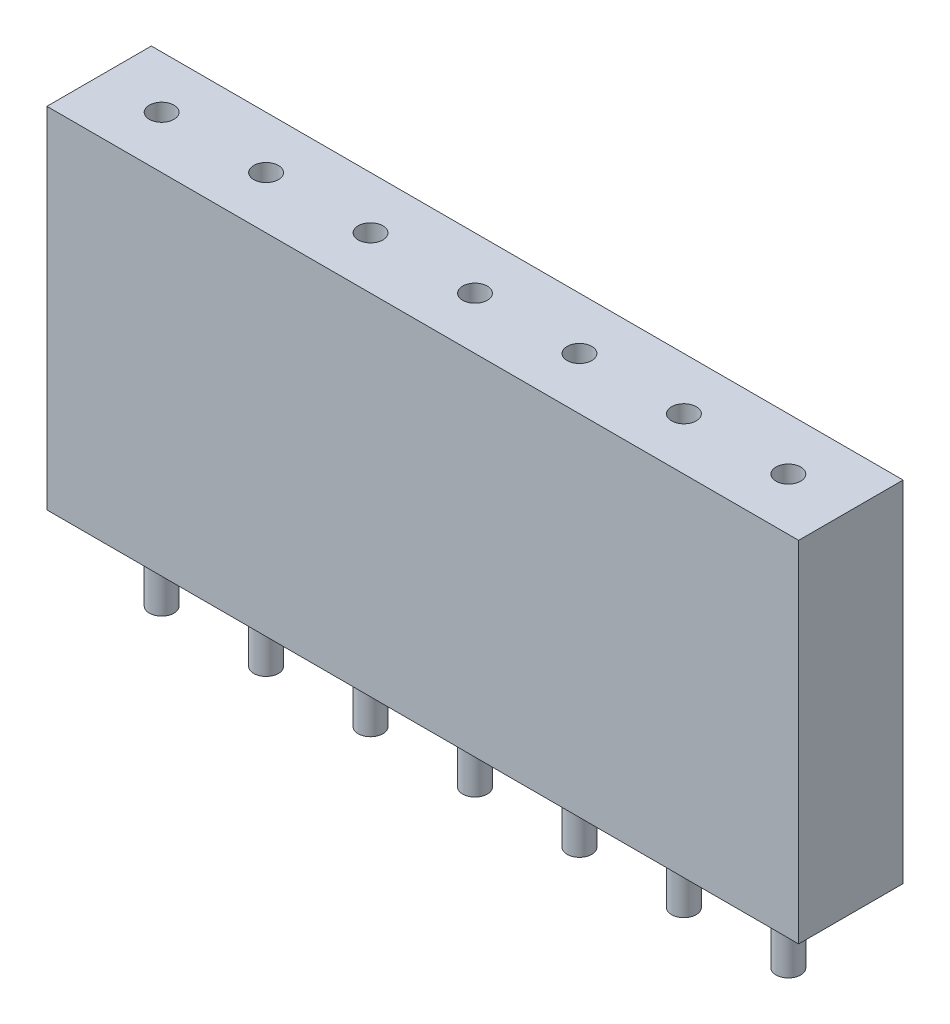
ISO-10303-21;
HEADER;
FILE_DESCRIPTION(('STEP AP214'),'2;1');
FILE_NAME('part.step','',(''),(''),'','','');
FILE_SCHEMA(('AUTOMOTIVE_DESIGN { 1 0 10303 214 1 1 1 1 }'));
ENDSEC;
DATA;
#1=APPLICATION_CONTEXT('core data for automotive mechanical design processes');
#2=APPLICATION_PROTOCOL_DEFINITION('international standard','automotive_design',2000,#1);
#3=PRODUCT_CONTEXT('',#1,'mechanical');
#4=PRODUCT('Part','Part','',(#3));
#5=PRODUCT_RELATED_PRODUCT_CATEGORY('part','',(#4));
#6=PRODUCT_DEFINITION_FORMATION('','',#4);
#7=PRODUCT_DEFINITION_CONTEXT('part definition',#1,'design');
#8=PRODUCT_DEFINITION('design','',#6,#7);
#9=PRODUCT_DEFINITION_SHAPE('','',#8);
#10=(LENGTH_UNIT() NAMED_UNIT(*) SI_UNIT(.MILLI.,.METRE.));
#11=(NAMED_UNIT(*) PLANE_ANGLE_UNIT() SI_UNIT($,.RADIAN.));
#12=(NAMED_UNIT(*) SI_UNIT($,.STERADIAN.) SOLID_ANGLE_UNIT());
#13=UNCERTAINTY_MEASURE_WITH_UNIT(LENGTH_MEASURE(1.E-05),#10,'distance_accuracy_value','');
#14=(GEOMETRIC_REPRESENTATION_CONTEXT(3) GLOBAL_UNCERTAINTY_ASSIGNED_CONTEXT((#13)) GLOBAL_UNIT_ASSIGNED_CONTEXT((#10,
#11,#12)) REPRESENTATION_CONTEXT('',''));
#15=CARTESIAN_POINT('',(0.,0.,0.));
#16=DIRECTION('',(0.,0.,1.));
#17=DIRECTION('',(1.,0.,0.));
#18=AXIS2_PLACEMENT_3D('',#15,#16,#17);
#19=CARTESIAN_POINT('',(7.61999999999998,-1.9,0.));
#20=DIRECTION('',(0.,1.,0.));
#21=DIRECTION('',(0.,0.,1.));
#22=AXIS2_PLACEMENT_3D('',#19,#20,#21);
#23=CYLINDRICAL_SURFACE('',#22,0.3);
#24=CARTESIAN_POINT('',(7.61999999999998,-1.9,0.));
#25=DIRECTION('',(0.,-1.,0.));
#26=DIRECTION('',(0.,0.,-1.));
#27=AXIS2_PLACEMENT_3D('',#24,#25,#26);
#28=CIRCLE('',#27,0.3);
#29=CARTESIAN_POINT('',(7.61999999999998,-1.9,-0.3));
#30=VERTEX_POINT('',#29);
#31=EDGE_CURVE('E11',#30,#30,#28,.T.);
#32=ORIENTED_EDGE('',*,*,#31,.F.);
#33=EDGE_LOOP('',(#32));
#34=FACE_BOUND('',#33,.T.);
#35=CARTESIAN_POINT('',(7.61999999999998,0.,0.));
#36=DIRECTION('',(0.,-1.,0.));
#37=DIRECTION('',(0.,0.,-1.));
#38=AXIS2_PLACEMENT_3D('',#35,#36,#37);
#39=CIRCLE('',#38,0.3);
#40=CARTESIAN_POINT('',(7.61999999999998,0.,-0.3));
#41=VERTEX_POINT('',#40);
#42=EDGE_CURVE('E42',#41,#41,#39,.T.);
#43=ORIENTED_EDGE('',*,*,#42,.T.);
#44=EDGE_LOOP('',(#43));
#45=FACE_BOUND('',#44,.T.);
#46=ADVANCED_FACE('F39',(#34,#45),#23,.T.);
#47=CARTESIAN_POINT('',(7.61999999999998,-1.9,0.));
#48=DIRECTION('',(0.,-1.,0.));
#49=DIRECTION('',(0.,0.,-1.));
#50=AXIS2_PLACEMENT_3D('',#47,#48,#49);
#51=PLANE('',#50);
#52=ORIENTED_EDGE('',*,*,#31,.T.);
#53=EDGE_LOOP('',(#52));
#54=FACE_BOUND('',#53,.T.);
#55=ADVANCED_FACE('F54',(#54),#51,.T.);
#56=CARTESIAN_POINT('',(7.61999999999998,0.,0.));
#57=DIRECTION('',(0.,-1.,0.));
#58=DIRECTION('',(0.,0.,-1.));
#59=AXIS2_PLACEMENT_3D('',#56,#57,#58);
#60=PLANE('',#59);
#61=ORIENTED_EDGE('',*,*,#42,.F.);
#62=EDGE_LOOP('',(#61));
#63=FACE_BOUND('',#62,.T.);
#64=ADVANCED_FACE('F52',(#63),#60,.F.);
#65=CLOSED_SHELL('',(#46,#55,#64));
#66=MANIFOLD_SOLID_BREP('B2',#65);
#67=CARTESIAN_POINT('',(5.07999999999998,-1.9,0.));
#68=DIRECTION('',(0.,1.,0.));
#69=DIRECTION('',(0.,0.,1.));
#70=AXIS2_PLACEMENT_3D('',#67,#68,#69);
#71=CYLINDRICAL_SURFACE('',#70,0.3);
#72=CARTESIAN_POINT('',(5.07999999999998,-1.9,0.));
#73=DIRECTION('',(0.,-1.,0.));
#74=DIRECTION('',(0.,0.,-1.));
#75=AXIS2_PLACEMENT_3D('',#72,#73,#74);
#76=CIRCLE('',#75,0.3);
#77=CARTESIAN_POINT('',(5.07999999999998,-1.9,-0.3));
#78=VERTEX_POINT('',#77);
#79=EDGE_CURVE('E38',#78,#78,#76,.T.);
#80=ORIENTED_EDGE('',*,*,#79,.F.);
#81=EDGE_LOOP('',(#80));
#82=FACE_BOUND('',#81,.T.);
#83=CARTESIAN_POINT('',(5.07999999999998,0.,0.));
#84=DIRECTION('',(0.,-1.,0.));
#85=DIRECTION('',(0.,0.,-1.));
#86=AXIS2_PLACEMENT_3D('',#83,#84,#85);
#87=CIRCLE('',#86,0.3);
#88=CARTESIAN_POINT('',(5.07999999999998,0.,-0.3));
#89=VERTEX_POINT('',#88);
#90=EDGE_CURVE('E90',#89,#89,#87,.T.);
#91=ORIENTED_EDGE('',*,*,#90,.T.);
#92=EDGE_LOOP('',(#91));
#93=FACE_BOUND('',#92,.T.);
#94=ADVANCED_FACE('F87',(#82,#93),#71,.T.);
#95=CARTESIAN_POINT('',(5.07999999999998,-1.9,0.));
#96=DIRECTION('',(0.,-1.,0.));
#97=DIRECTION('',(0.,0.,-1.));
#98=AXIS2_PLACEMENT_3D('',#95,#96,#97);
#99=PLANE('',#98);
#100=ORIENTED_EDGE('',*,*,#79,.T.);
#101=EDGE_LOOP('',(#100));
#102=FACE_BOUND('',#101,.T.);
#103=ADVANCED_FACE('F102',(#102),#99,.T.);
#104=CARTESIAN_POINT('',(5.07999999999998,0.,0.));
#105=DIRECTION('',(0.,-1.,0.));
#106=DIRECTION('',(0.,0.,-1.));
#107=AXIS2_PLACEMENT_3D('',#104,#105,#106);
#108=PLANE('',#107);
#109=ORIENTED_EDGE('',*,*,#90,.F.);
#110=EDGE_LOOP('',(#109));
#111=FACE_BOUND('',#110,.T.);
#112=ADVANCED_FACE('F100',(#111),#108,.F.);
#113=CLOSED_SHELL('',(#94,#103,#112));
#114=MANIFOLD_SOLID_BREP('B6',#113);
#115=CARTESIAN_POINT('',(2.53999999999998,-1.9,0.));
#116=DIRECTION('',(0.,1.,0.));
#117=DIRECTION('',(0.,0.,1.));
#118=AXIS2_PLACEMENT_3D('',#115,#116,#117);
#119=CYLINDRICAL_SURFACE('',#118,0.3);
#120=CARTESIAN_POINT('',(2.53999999999998,-1.9,0.));
#121=DIRECTION('',(0.,-1.,0.));
#122=DIRECTION('',(0.,0.,-1.));
#123=AXIS2_PLACEMENT_3D('',#120,#121,#122);
#124=CIRCLE('',#123,0.3);
#125=CARTESIAN_POINT('',(2.53999999999998,-1.9,-0.3));
#126=VERTEX_POINT('',#125);
#127=EDGE_CURVE('E86',#126,#126,#124,.T.);
#128=ORIENTED_EDGE('',*,*,#127,.F.);
#129=EDGE_LOOP('',(#128));
#130=FACE_BOUND('',#129,.T.);
#131=CARTESIAN_POINT('',(2.53999999999998,0.,0.));
#132=DIRECTION('',(0.,-1.,0.));
#133=DIRECTION('',(0.,0.,-1.));
#134=AXIS2_PLACEMENT_3D('',#131,#132,#133);
#135=CIRCLE('',#134,0.3);
#136=CARTESIAN_POINT('',(2.53999999999998,0.,-0.3));
#137=VERTEX_POINT('',#136);
#138=EDGE_CURVE('E138',#137,#137,#135,.T.);
#139=ORIENTED_EDGE('',*,*,#138,.T.);
#140=EDGE_LOOP('',(#139));
#141=FACE_BOUND('',#140,.T.);
#142=ADVANCED_FACE('F135',(#130,#141),#119,.T.);
#143=CARTESIAN_POINT('',(2.53999999999998,-1.9,0.));
#144=DIRECTION('',(0.,-1.,0.));
#145=DIRECTION('',(0.,0.,-1.));
#146=AXIS2_PLACEMENT_3D('',#143,#144,#145);
#147=PLANE('',#146);
#148=ORIENTED_EDGE('',*,*,#127,.T.);
#149=EDGE_LOOP('',(#148));
#150=FACE_BOUND('',#149,.T.);
#151=ADVANCED_FACE('F150',(#150),#147,.T.);
#152=CARTESIAN_POINT('',(2.53999999999998,0.,0.));
#153=DIRECTION('',(0.,-1.,0.));
#154=DIRECTION('',(0.,0.,-1.));
#155=AXIS2_PLACEMENT_3D('',#152,#153,#154);
#156=PLANE('',#155);
#157=ORIENTED_EDGE('',*,*,#138,.F.);
#158=EDGE_LOOP('',(#157));
#159=FACE_BOUND('',#158,.T.);
#160=ADVANCED_FACE('F148',(#159),#156,.F.);
#161=CLOSED_SHELL('',(#142,#151,#160));
#162=MANIFOLD_SOLID_BREP('B33',#161);
#163=CARTESIAN_POINT('',(0.,-1.9,0.));
#164=DIRECTION('',(0.,1.,0.));
#165=DIRECTION('',(0.,0.,1.));
#166=AXIS2_PLACEMENT_3D('',#163,#164,#165);
#167=CYLINDRICAL_SURFACE('',#166,0.3);
#168=CARTESIAN_POINT('',(0.,-1.9,0.));
#169=DIRECTION('',(0.,-1.,0.));
#170=DIRECTION('',(0.,0.,-1.));
#171=AXIS2_PLACEMENT_3D('',#168,#169,#170);
#172=CIRCLE('',#171,0.3);
#173=CARTESIAN_POINT('',(0.,-1.9,-0.3));
#174=VERTEX_POINT('',#173);
#175=EDGE_CURVE('E134',#174,#174,#172,.T.);
#176=ORIENTED_EDGE('',*,*,#175,.F.);
#177=EDGE_LOOP('',(#176));
#178=FACE_BOUND('',#177,.T.);
#179=CARTESIAN_POINT('',(0.,0.,0.));
#180=DIRECTION('',(0.,-1.,0.));
#181=DIRECTION('',(0.,0.,-1.));
#182=AXIS2_PLACEMENT_3D('',#179,#180,#181);
#183=CIRCLE('',#182,0.3);
#184=CARTESIAN_POINT('',(0.,0.,-0.3));
#185=VERTEX_POINT('',#184);
#186=EDGE_CURVE('E186',#185,#185,#183,.T.);
#187=ORIENTED_EDGE('',*,*,#186,.T.);
#188=EDGE_LOOP('',(#187));
#189=FACE_BOUND('',#188,.T.);
#190=ADVANCED_FACE('F183',(#178,#189),#167,.T.);
#191=CARTESIAN_POINT('',(0.,-1.9,0.));
#192=DIRECTION('',(0.,-1.,0.));
#193=DIRECTION('',(0.,0.,-1.));
#194=AXIS2_PLACEMENT_3D('',#191,#192,#193);
#195=PLANE('',#194);
#196=ORIENTED_EDGE('',*,*,#175,.T.);
#197=EDGE_LOOP('',(#196));
#198=FACE_BOUND('',#197,.T.);
#199=ADVANCED_FACE('F198',(#198),#195,.T.);
#200=CARTESIAN_POINT('',(0.,0.,0.));
#201=DIRECTION('',(0.,-1.,0.));
#202=DIRECTION('',(0.,0.,-1.));
#203=AXIS2_PLACEMENT_3D('',#200,#201,#202);
#204=PLANE('',#203);
#205=ORIENTED_EDGE('',*,*,#186,.F.);
#206=EDGE_LOOP('',(#205));
#207=FACE_BOUND('',#206,.T.);
#208=ADVANCED_FACE('F196',(#207),#204,.F.);
#209=CLOSED_SHELL('',(#190,#199,#208));
#210=MANIFOLD_SOLID_BREP('B81',#209);
#211=CARTESIAN_POINT('',(-2.54000000000002,-1.9,0.));
#212=DIRECTION('',(0.,1.,0.));
#213=DIRECTION('',(0.,0.,1.));
#214=AXIS2_PLACEMENT_3D('',#211,#212,#213);
#215=CYLINDRICAL_SURFACE('',#214,0.3);
#216=CARTESIAN_POINT('',(-2.54000000000002,-1.9,0.));
#217=DIRECTION('',(0.,-1.,0.));
#218=DIRECTION('',(0.,0.,-1.));
#219=AXIS2_PLACEMENT_3D('',#216,#217,#218);
#220=CIRCLE('',#219,0.3);
#221=CARTESIAN_POINT('',(-2.54000000000002,-1.9,-0.3));
#222=VERTEX_POINT('',#221);
#223=EDGE_CURVE('E182',#222,#222,#220,.T.);
#224=ORIENTED_EDGE('',*,*,#223,.F.);
#225=EDGE_LOOP('',(#224));
#226=FACE_BOUND('',#225,.T.);
#227=CARTESIAN_POINT('',(-2.54000000000002,0.,0.));
#228=DIRECTION('',(0.,-1.,0.));
#229=DIRECTION('',(0.,0.,-1.));
#230=AXIS2_PLACEMENT_3D('',#227,#228,#229);
#231=CIRCLE('',#230,0.3);
#232=CARTESIAN_POINT('',(-2.54000000000002,0.,-0.3));
#233=VERTEX_POINT('',#232);
#234=EDGE_CURVE('E234',#233,#233,#231,.T.);
#235=ORIENTED_EDGE('',*,*,#234,.T.);
#236=EDGE_LOOP('',(#235));
#237=FACE_BOUND('',#236,.T.);
#238=ADVANCED_FACE('F231',(#226,#237),#215,.T.);
#239=CARTESIAN_POINT('',(-2.54000000000002,-1.9,0.));
#240=DIRECTION('',(0.,-1.,0.));
#241=DIRECTION('',(0.,0.,-1.));
#242=AXIS2_PLACEMENT_3D('',#239,#240,#241);
#243=PLANE('',#242);
#244=ORIENTED_EDGE('',*,*,#223,.T.);
#245=EDGE_LOOP('',(#244));
#246=FACE_BOUND('',#245,.T.);
#247=ADVANCED_FACE('F246',(#246),#243,.T.);
#248=CARTESIAN_POINT('',(-2.54000000000002,0.,0.));
#249=DIRECTION('',(0.,-1.,0.));
#250=DIRECTION('',(0.,0.,-1.));
#251=AXIS2_PLACEMENT_3D('',#248,#249,#250);
#252=PLANE('',#251);
#253=ORIENTED_EDGE('',*,*,#234,.F.);
#254=EDGE_LOOP('',(#253));
#255=FACE_BOUND('',#254,.T.);
#256=ADVANCED_FACE('F244',(#255),#252,.F.);
#257=CLOSED_SHELL('',(#238,#247,#256));
#258=MANIFOLD_SOLID_BREP('B129',#257);
#259=CARTESIAN_POINT('',(-7.62000000000002,-1.9,0.));
#260=DIRECTION('',(0.,1.,0.));
#261=DIRECTION('',(0.,0.,1.));
#262=AXIS2_PLACEMENT_3D('',#259,#260,#261);
#263=CYLINDRICAL_SURFACE('',#262,0.3);
#264=CARTESIAN_POINT('',(-7.62000000000002,-1.9,0.));
#265=DIRECTION('',(0.,-1.,0.));
#266=DIRECTION('',(0.,0.,-1.));
#267=AXIS2_PLACEMENT_3D('',#264,#265,#266);
#268=CIRCLE('',#267,0.3);
#269=CARTESIAN_POINT('',(-7.62000000000002,-1.9,-0.3));
#270=VERTEX_POINT('',#269);
#271=EDGE_CURVE('E230',#270,#270,#268,.T.);
#272=ORIENTED_EDGE('',*,*,#271,.F.);
#273=EDGE_LOOP('',(#272));
#274=FACE_BOUND('',#273,.T.);
#275=CARTESIAN_POINT('',(-7.62000000000002,0.,0.));
#276=DIRECTION('',(0.,-1.,0.));
#277=DIRECTION('',(0.,0.,-1.));
#278=AXIS2_PLACEMENT_3D('',#275,#276,#277);
#279=CIRCLE('',#278,0.3);
#280=CARTESIAN_POINT('',(-7.62000000000002,0.,-0.3));
#281=VERTEX_POINT('',#280);
#282=EDGE_CURVE('E282',#281,#281,#279,.T.);
#283=ORIENTED_EDGE('',*,*,#282,.T.);
#284=EDGE_LOOP('',(#283));
#285=FACE_BOUND('',#284,.T.);
#286=ADVANCED_FACE('F279',(#274,#285),#263,.T.);
#287=CARTESIAN_POINT('',(-7.62000000000002,-1.9,0.));
#288=DIRECTION('',(0.,-1.,0.));
#289=DIRECTION('',(0.,0.,-1.));
#290=AXIS2_PLACEMENT_3D('',#287,#288,#289);
#291=PLANE('',#290);
#292=ORIENTED_EDGE('',*,*,#271,.T.);
#293=EDGE_LOOP('',(#292));
#294=FACE_BOUND('',#293,.T.);
#295=ADVANCED_FACE('F294',(#294),#291,.T.);
#296=CARTESIAN_POINT('',(-7.62000000000002,0.,0.));
#297=DIRECTION('',(0.,-1.,0.));
#298=DIRECTION('',(0.,0.,-1.));
#299=AXIS2_PLACEMENT_3D('',#296,#297,#298);
#300=PLANE('',#299);
#301=ORIENTED_EDGE('',*,*,#282,.F.);
#302=EDGE_LOOP('',(#301));
#303=FACE_BOUND('',#302,.T.);
#304=ADVANCED_FACE('F292',(#303),#300,.F.);
#305=CLOSED_SHELL('',(#286,#295,#304));
#306=MANIFOLD_SOLID_BREP('B177',#305);
#307=CARTESIAN_POINT('',(-5.08000000000002,-1.9,0.));
#308=DIRECTION('',(0.,1.,0.));
#309=DIRECTION('',(0.,0.,1.));
#310=AXIS2_PLACEMENT_3D('',#307,#308,#309);
#311=CYLINDRICAL_SURFACE('',#310,0.3);
#312=CARTESIAN_POINT('',(-5.08000000000002,-1.9,0.));
#313=DIRECTION('',(0.,-1.,0.));
#314=DIRECTION('',(0.,0.,-1.));
#315=AXIS2_PLACEMENT_3D('',#312,#313,#314);
#316=CIRCLE('',#315,0.3);
#317=CARTESIAN_POINT('',(-5.08000000000002,-1.9,-0.3));
#318=VERTEX_POINT('',#317);
#319=EDGE_CURVE('E278',#318,#318,#316,.T.);
#320=ORIENTED_EDGE('',*,*,#319,.F.);
#321=EDGE_LOOP('',(#320));
#322=FACE_BOUND('',#321,.T.);
#323=CARTESIAN_POINT('',(-5.08000000000002,0.,0.));
#324=DIRECTION('',(0.,-1.,0.));
#325=DIRECTION('',(0.,0.,-1.));
#326=AXIS2_PLACEMENT_3D('',#323,#324,#325);
#327=CIRCLE('',#326,0.3);
#328=CARTESIAN_POINT('',(-5.08000000000002,0.,-0.3));
#329=VERTEX_POINT('',#328);
#330=EDGE_CURVE('E331',#329,#329,#327,.T.);
#331=ORIENTED_EDGE('',*,*,#330,.T.);
#332=EDGE_LOOP('',(#331));
#333=FACE_BOUND('',#332,.T.);
#334=ADVANCED_FACE('F328',(#322,#333),#311,.T.);
#335=CARTESIAN_POINT('',(-5.08000000000002,-1.9,0.));
#336=DIRECTION('',(0.,-1.,0.));
#337=DIRECTION('',(0.,0.,-1.));
#338=AXIS2_PLACEMENT_3D('',#335,#336,#337);
#339=PLANE('',#338);
#340=ORIENTED_EDGE('',*,*,#319,.T.);
#341=EDGE_LOOP('',(#340));
#342=FACE_BOUND('',#341,.T.);
#343=ADVANCED_FACE('F343',(#342),#339,.T.);
#344=CARTESIAN_POINT('',(-5.08000000000002,0.,0.));
#345=DIRECTION('',(0.,-1.,0.));
#346=DIRECTION('',(0.,0.,-1.));
#347=AXIS2_PLACEMENT_3D('',#344,#345,#346);
#348=PLANE('',#347);
#349=ORIENTED_EDGE('',*,*,#330,.F.);
#350=EDGE_LOOP('',(#349));
#351=FACE_BOUND('',#350,.T.);
#352=ADVANCED_FACE('F341',(#351),#348,.F.);
#353=CLOSED_SHELL('',(#334,#343,#352));
#354=MANIFOLD_SOLID_BREP('B225',#353);
#355=CARTESIAN_POINT('',(9.14,8.5,-1.27));
#356=DIRECTION('',(-1.,0.,0.));
#357=DIRECTION('',(0.,0.,1.));
#358=AXIS2_PLACEMENT_3D('',#355,#356,#357);
#359=PLANE('',#358);
#360=DIRECTION('',(0.,0.,-1.));
#361=VECTOR('',#360,1.);
#362=CARTESIAN_POINT('',(9.14,0.,-1.27));
#363=LINE('',#362,#361);
#364=CARTESIAN_POINT('',(9.14,0.,1.27));
#365=VERTEX_POINT('',#364);
#366=CARTESIAN_POINT('',(9.14,0.,-1.27));
#367=VERTEX_POINT('',#366);
#368=EDGE_CURVE('E431',#365,#367,#363,.T.);
#369=ORIENTED_EDGE('',*,*,#368,.T.);
#370=DIRECTION('',(0.,-1.,0.));
#371=VECTOR('',#370,1.);
#372=CARTESIAN_POINT('',(9.14,8.5,-1.27));
#373=LINE('',#372,#371);
#374=CARTESIAN_POINT('',(9.14,8.5,-1.27));
#375=VERTEX_POINT('',#374);
#376=EDGE_CURVE('E326',#375,#367,#373,.T.);
#377=ORIENTED_EDGE('',*,*,#376,.F.);
#378=DIRECTION('',(0.,0.,-1.));
#379=VECTOR('',#378,1.);
#380=CARTESIAN_POINT('',(9.14,8.5,-1.27));
#381=LINE('',#380,#379);
#382=CARTESIAN_POINT('',(9.14,8.5,1.27));
#383=VERTEX_POINT('',#382);
#384=EDGE_CURVE('E419',#383,#375,#381,.T.);
#385=ORIENTED_EDGE('',*,*,#384,.F.);
#386=DIRECTION('',(0.,-1.,0.));
#387=VECTOR('',#386,1.);
#388=CARTESIAN_POINT('',(9.14,8.5,1.27));
#389=LINE('',#388,#387);
#390=EDGE_CURVE('E427',#383,#365,#389,.T.);
#391=ORIENTED_EDGE('',*,*,#390,.T.);
#392=EDGE_LOOP('',(#369,#377,#385,#391));
#393=FACE_BOUND('',#392,.T.);
#394=ADVANCED_FACE('F368',(#393),#359,.F.);
#395=CARTESIAN_POINT('',(-9.14,8.5,-1.27));
#396=DIRECTION('',(0.,0.,1.));
#397=DIRECTION('',(1.,0.,0.));
#398=AXIS2_PLACEMENT_3D('',#395,#396,#397);
#399=PLANE('',#398);
#400=DIRECTION('',(-1.,0.,0.));
#401=VECTOR('',#400,1.);
#402=CARTESIAN_POINT('',(-9.14,0.,-1.27));
#403=LINE('',#402,#401);
#404=CARTESIAN_POINT('',(-9.14,0.,-1.27));
#405=VERTEX_POINT('',#404);
#406=EDGE_CURVE('E423',#367,#405,#403,.T.);
#407=ORIENTED_EDGE('',*,*,#406,.T.);
#408=DIRECTION('',(0.,-1.,0.));
#409=VECTOR('',#408,1.);
#410=CARTESIAN_POINT('',(-9.14,8.5,-1.27));
#411=LINE('',#410,#409);
#412=CARTESIAN_POINT('',(-9.14,8.5,-1.27));
#413=VERTEX_POINT('',#412);
#414=EDGE_CURVE('E376',#413,#405,#411,.T.);
#415=ORIENTED_EDGE('',*,*,#414,.F.);
#416=DIRECTION('',(-1.,0.,0.));
#417=VECTOR('',#416,1.);
#418=CARTESIAN_POINT('',(-9.14,8.5,-1.27));
#419=LINE('',#418,#417);
#420=EDGE_CURVE('E414',#375,#413,#419,.T.);
#421=ORIENTED_EDGE('',*,*,#420,.F.);
#422=ORIENTED_EDGE('',*,*,#376,.T.);
#423=EDGE_LOOP('',(#407,#415,#421,#422));
#424=FACE_BOUND('',#423,.T.);
#425=ADVANCED_FACE('F422',(#424),#399,.F.);
#426=CARTESIAN_POINT('',(-9.14,8.5,-1.27));
#427=DIRECTION('',(1.,0.,0.));
#428=DIRECTION('',(0.,0.,-1.));
#429=AXIS2_PLACEMENT_3D('',#426,#427,#428);
#430=PLANE('',#429);
#431=DIRECTION('',(0.,0.,1.));
#432=VECTOR('',#431,1.);
#433=CARTESIAN_POINT('',(-9.14,0.,-1.27));
#434=LINE('',#433,#432);
#435=CARTESIAN_POINT('',(-9.14,0.,1.27));
#436=VERTEX_POINT('',#435);
#437=EDGE_CURVE('E401',#405,#436,#434,.T.);
#438=ORIENTED_EDGE('',*,*,#437,.T.);
#439=DIRECTION('',(0.,-1.,0.));
#440=VECTOR('',#439,1.);
#441=CARTESIAN_POINT('',(-9.14,8.5,1.27));
#442=LINE('',#441,#440);
#443=CARTESIAN_POINT('',(-9.14,8.5,1.27));
#444=VERTEX_POINT('',#443);
#445=EDGE_CURVE('E424',#444,#436,#442,.T.);
#446=ORIENTED_EDGE('',*,*,#445,.F.);
#447=DIRECTION('',(0.,0.,1.));
#448=VECTOR('',#447,1.);
#449=CARTESIAN_POINT('',(-9.14,8.5,-1.27));
#450=LINE('',#449,#448);
#451=EDGE_CURVE('E417',#413,#444,#450,.T.);
#452=ORIENTED_EDGE('',*,*,#451,.F.);
#453=ORIENTED_EDGE('',*,*,#414,.T.);
#454=EDGE_LOOP('',(#438,#446,#452,#453));
#455=FACE_BOUND('',#454,.T.);
#456=ADVANCED_FACE('F425',(#455),#430,.F.);
#457=CARTESIAN_POINT('',(-9.14,8.5,1.27));
#458=DIRECTION('',(0.,0.,-1.));
#459=DIRECTION('',(-1.,0.,0.));
#460=AXIS2_PLACEMENT_3D('',#457,#458,#459);
#461=PLANE('',#460);
#462=DIRECTION('',(1.,0.,0.));
#463=VECTOR('',#462,1.);
#464=CARTESIAN_POINT('',(-9.14,0.,1.27));
#465=LINE('',#464,#463);
#466=EDGE_CURVE('E407',#436,#365,#465,.T.);
#467=ORIENTED_EDGE('',*,*,#466,.T.);
#468=ORIENTED_EDGE('',*,*,#390,.F.);
#469=DIRECTION('',(1.,0.,0.));
#470=VECTOR('',#469,1.);
#471=CARTESIAN_POINT('',(-9.14,8.5,1.27));
#472=LINE('',#471,#470);
#473=EDGE_CURVE('E384',#444,#383,#472,.T.);
#474=ORIENTED_EDGE('',*,*,#473,.F.);
#475=ORIENTED_EDGE('',*,*,#445,.T.);
#476=EDGE_LOOP('',(#467,#468,#474,#475));
#477=FACE_BOUND('',#476,.T.);
#478=ADVANCED_FACE('F439',(#477),#461,.F.);
#479=CARTESIAN_POINT('',(0.,8.5,0.));
#480=DIRECTION('',(0.,1.,0.));
#481=DIRECTION('',(0.,0.,1.));
#482=AXIS2_PLACEMENT_3D('',#479,#480,#481);
#483=PLANE('',#482);
#484=CARTESIAN_POINT('',(7.61999999999998,8.5,0.));
#485=DIRECTION('',(0.,1.,0.));
#486=DIRECTION('',(0.,0.,1.));
#487=AXIS2_PLACEMENT_3D('',#484,#485,#486);
#488=CIRCLE('',#487,0.3);
#489=CARTESIAN_POINT('',(7.61999999999998,8.5,0.3));
#490=VERTEX_POINT('',#489);
#491=EDGE_CURVE('E481',#490,#490,#488,.T.);
#492=ORIENTED_EDGE('',*,*,#491,.F.);
#493=EDGE_LOOP('',(#492));
#494=FACE_BOUND('',#493,.T.);
#495=CARTESIAN_POINT('',(5.07999999999998,8.5,0.));
#496=DIRECTION('',(0.,1.,0.));
#497=DIRECTION('',(0.,0.,1.));
#498=AXIS2_PLACEMENT_3D('',#495,#496,#497);
#499=CIRCLE('',#498,0.3);
#500=CARTESIAN_POINT('',(5.07999999999998,8.5,0.3));
#501=VERTEX_POINT('',#500);
#502=EDGE_CURVE('E475',#501,#501,#499,.T.);
#503=ORIENTED_EDGE('',*,*,#502,.F.);
#504=EDGE_LOOP('',(#503));
#505=FACE_BOUND('',#504,.T.);
#506=CARTESIAN_POINT('',(2.53999999999998,8.5,0.));
#507=DIRECTION('',(0.,1.,0.));
#508=DIRECTION('',(0.,0.,1.));
#509=AXIS2_PLACEMENT_3D('',#506,#507,#508);
#510=CIRCLE('',#509,0.3);
#511=CARTESIAN_POINT('',(2.53999999999998,8.5,0.3));
#512=VERTEX_POINT('',#511);
#513=EDGE_CURVE('E469',#512,#512,#510,.T.);
#514=ORIENTED_EDGE('',*,*,#513,.F.);
#515=EDGE_LOOP('',(#514));
#516=FACE_BOUND('',#515,.T.);
#517=CARTESIAN_POINT('',(0.,8.5,0.));
#518=DIRECTION('',(0.,1.,0.));
#519=DIRECTION('',(0.,0.,1.));
#520=AXIS2_PLACEMENT_3D('',#517,#518,#519);
#521=CIRCLE('',#520,0.3);
#522=CARTESIAN_POINT('',(0.,8.5,0.3));
#523=VERTEX_POINT('',#522);
#524=EDGE_CURVE('E463',#523,#523,#521,.T.);
#525=ORIENTED_EDGE('',*,*,#524,.F.);
#526=EDGE_LOOP('',(#525));
#527=FACE_BOUND('',#526,.T.);
#528=CARTESIAN_POINT('',(-2.54000000000002,8.5,0.));
#529=DIRECTION('',(0.,1.,0.));
#530=DIRECTION('',(0.,0.,1.));
#531=AXIS2_PLACEMENT_3D('',#528,#529,#530);
#532=CIRCLE('',#531,0.3);
#533=CARTESIAN_POINT('',(-2.54000000000002,8.5,0.3));
#534=VERTEX_POINT('',#533);
#535=EDGE_CURVE('E457',#534,#534,#532,.T.);
#536=ORIENTED_EDGE('',*,*,#535,.F.);
#537=EDGE_LOOP('',(#536));
#538=FACE_BOUND('',#537,.T.);
#539=CARTESIAN_POINT('',(-7.62000000000002,8.5,0.));
#540=DIRECTION('',(0.,1.,0.));
#541=DIRECTION('',(0.,0.,1.));
#542=AXIS2_PLACEMENT_3D('',#539,#540,#541);
#543=CIRCLE('',#542,0.3);
#544=CARTESIAN_POINT('',(-7.62000000000002,8.5,0.3));
#545=VERTEX_POINT('',#544);
#546=EDGE_CURVE('E451',#545,#545,#543,.T.);
#547=ORIENTED_EDGE('',*,*,#546,.F.);
#548=EDGE_LOOP('',(#547));
#549=FACE_BOUND('',#548,.T.);
#550=CARTESIAN_POINT('',(-5.08000000000002,8.5,0.));
#551=DIRECTION('',(0.,1.,0.));
#552=DIRECTION('',(0.,0.,1.));
#553=AXIS2_PLACEMENT_3D('',#550,#551,#552);
#554=CIRCLE('',#553,0.3);
#555=CARTESIAN_POINT('',(-5.08000000000002,8.5,0.3));
#556=VERTEX_POINT('',#555);
#557=EDGE_CURVE('E445',#556,#556,#554,.T.);
#558=ORIENTED_EDGE('',*,*,#557,.F.);
#559=EDGE_LOOP('',(#558));
#560=FACE_BOUND('',#559,.T.);
#561=ORIENTED_EDGE('',*,*,#384,.T.);
#562=ORIENTED_EDGE('',*,*,#420,.T.);
#563=ORIENTED_EDGE('',*,*,#451,.T.);
#564=ORIENTED_EDGE('',*,*,#473,.T.);
#565=EDGE_LOOP('',(#561,#562,#563,#564));
#566=FACE_BOUND('',#565,.T.);
#567=ADVANCED_FACE('F415',(#494,#505,#516,#527,#538,#549,#560,#566),#483,.T.);
#568=CARTESIAN_POINT('',(0.,0.,0.));
#569=DIRECTION('',(0.,1.,0.));
#570=DIRECTION('',(0.,0.,1.));
#571=AXIS2_PLACEMENT_3D('',#568,#569,#570);
#572=PLANE('',#571);
#573=CARTESIAN_POINT('',(7.61999999999998,0.,0.));
#574=DIRECTION('',(0.,1.,0.));
#575=DIRECTION('',(0.,0.,1.));
#576=AXIS2_PLACEMENT_3D('',#573,#574,#575);
#577=CIRCLE('',#576,0.3);
#578=CARTESIAN_POINT('',(7.61999999999998,0.,0.3));
#579=VERTEX_POINT('',#578);
#580=EDGE_CURVE('E478',#579,#579,#577,.T.);
#581=ORIENTED_EDGE('',*,*,#580,.T.);
#582=EDGE_LOOP('',(#581));
#583=FACE_BOUND('',#582,.T.);
#584=CARTESIAN_POINT('',(5.07999999999998,0.,0.));
#585=DIRECTION('',(0.,1.,0.));
#586=DIRECTION('',(0.,0.,1.));
#587=AXIS2_PLACEMENT_3D('',#584,#585,#586);
#588=CIRCLE('',#587,0.3);
#589=CARTESIAN_POINT('',(5.07999999999998,0.,0.3));
#590=VERTEX_POINT('',#589);
#591=EDGE_CURVE('E472',#590,#590,#588,.T.);
#592=ORIENTED_EDGE('',*,*,#591,.T.);
#593=EDGE_LOOP('',(#592));
#594=FACE_BOUND('',#593,.T.);
#595=CARTESIAN_POINT('',(2.53999999999998,0.,0.));
#596=DIRECTION('',(0.,1.,0.));
#597=DIRECTION('',(0.,0.,1.));
#598=AXIS2_PLACEMENT_3D('',#595,#596,#597);
#599=CIRCLE('',#598,0.3);
#600=CARTESIAN_POINT('',(2.53999999999998,0.,0.3));
#601=VERTEX_POINT('',#600);
#602=EDGE_CURVE('E466',#601,#601,#599,.T.);
#603=ORIENTED_EDGE('',*,*,#602,.T.);
#604=EDGE_LOOP('',(#603));
#605=FACE_BOUND('',#604,.T.);
#606=CARTESIAN_POINT('',(0.,0.,0.));
#607=DIRECTION('',(0.,1.,0.));
#608=DIRECTION('',(0.,0.,1.));
#609=AXIS2_PLACEMENT_3D('',#606,#607,#608);
#610=CIRCLE('',#609,0.3);
#611=CARTESIAN_POINT('',(0.,0.,0.3));
#612=VERTEX_POINT('',#611);
#613=EDGE_CURVE('E460',#612,#612,#610,.T.);
#614=ORIENTED_EDGE('',*,*,#613,.T.);
#615=EDGE_LOOP('',(#614));
#616=FACE_BOUND('',#615,.T.);
#617=CARTESIAN_POINT('',(-2.54000000000002,0.,0.));
#618=DIRECTION('',(0.,1.,0.));
#619=DIRECTION('',(0.,0.,1.));
#620=AXIS2_PLACEMENT_3D('',#617,#618,#619);
#621=CIRCLE('',#620,0.3);
#622=CARTESIAN_POINT('',(-2.54000000000002,0.,0.3));
#623=VERTEX_POINT('',#622);
#624=EDGE_CURVE('E454',#623,#623,#621,.T.);
#625=ORIENTED_EDGE('',*,*,#624,.T.);
#626=EDGE_LOOP('',(#625));
#627=FACE_BOUND('',#626,.T.);
#628=CARTESIAN_POINT('',(-7.62000000000002,0.,0.));
#629=DIRECTION('',(0.,1.,0.));
#630=DIRECTION('',(0.,0.,1.));
#631=AXIS2_PLACEMENT_3D('',#628,#629,#630);
#632=CIRCLE('',#631,0.3);
#633=CARTESIAN_POINT('',(-7.62000000000002,0.,0.3));
#634=VERTEX_POINT('',#633);
#635=EDGE_CURVE('E448',#634,#634,#632,.T.);
#636=ORIENTED_EDGE('',*,*,#635,.T.);
#637=EDGE_LOOP('',(#636));
#638=FACE_BOUND('',#637,.T.);
#639=CARTESIAN_POINT('',(-5.08000000000002,0.,0.));
#640=DIRECTION('',(0.,1.,0.));
#641=DIRECTION('',(0.,0.,1.));
#642=AXIS2_PLACEMENT_3D('',#639,#640,#641);
#643=CIRCLE('',#642,0.3);
#644=CARTESIAN_POINT('',(-5.08000000000002,0.,0.3));
#645=VERTEX_POINT('',#644);
#646=EDGE_CURVE('E434',#645,#645,#643,.T.);
#647=ORIENTED_EDGE('',*,*,#646,.T.);
#648=EDGE_LOOP('',(#647));
#649=FACE_BOUND('',#648,.T.);
#650=ORIENTED_EDGE('',*,*,#368,.F.);
#651=ORIENTED_EDGE('',*,*,#466,.F.);
#652=ORIENTED_EDGE('',*,*,#437,.F.);
#653=ORIENTED_EDGE('',*,*,#406,.F.);
#654=EDGE_LOOP('',(#650,#651,#652,#653));
#655=FACE_BOUND('',#654,.T.);
#656=ADVANCED_FACE('F442',(#583,#594,#605,#616,#627,#638,#649,#655),#572,.F.);
#657=CARTESIAN_POINT('',(-5.08000000000002,0.,0.));
#658=DIRECTION('',(0.,1.,0.));
#659=DIRECTION('',(0.,0.,1.));
#660=AXIS2_PLACEMENT_3D('',#657,#658,#659);
#661=CYLINDRICAL_SURFACE('',#660,0.3);
#662=ORIENTED_EDGE('',*,*,#646,.F.);
#663=EDGE_LOOP('',(#662));
#664=FACE_BOUND('',#663,.T.);
#665=ORIENTED_EDGE('',*,*,#557,.T.);
#666=EDGE_LOOP('',(#665));
#667=FACE_BOUND('',#666,.T.);
#668=ADVANCED_FACE('F511',(#664,#667),#661,.F.);
#669=CARTESIAN_POINT('',(-7.62000000000002,0.,0.));
#670=DIRECTION('',(0.,1.,0.));
#671=DIRECTION('',(0.,0.,1.));
#672=AXIS2_PLACEMENT_3D('',#669,#670,#671);
#673=CYLINDRICAL_SURFACE('',#672,0.3);
#674=ORIENTED_EDGE('',*,*,#635,.F.);
#675=EDGE_LOOP('',(#674));
#676=FACE_BOUND('',#675,.T.);
#677=ORIENTED_EDGE('',*,*,#546,.T.);
#678=EDGE_LOOP('',(#677));
#679=FACE_BOUND('',#678,.T.);
#680=ADVANCED_FACE('F513',(#676,#679),#673,.F.);
#681=CARTESIAN_POINT('',(-2.54000000000002,0.,0.));
#682=DIRECTION('',(0.,1.,0.));
#683=DIRECTION('',(0.,0.,1.));
#684=AXIS2_PLACEMENT_3D('',#681,#682,#683);
#685=CYLINDRICAL_SURFACE('',#684,0.3);
#686=ORIENTED_EDGE('',*,*,#624,.F.);
#687=EDGE_LOOP('',(#686));
#688=FACE_BOUND('',#687,.T.);
#689=ORIENTED_EDGE('',*,*,#535,.T.);
#690=EDGE_LOOP('',(#689));
#691=FACE_BOUND('',#690,.T.);
#692=ADVANCED_FACE('F520',(#688,#691),#685,.F.);
#693=CARTESIAN_POINT('',(0.,0.,0.));
#694=DIRECTION('',(0.,1.,0.));
#695=DIRECTION('',(0.,0.,1.));
#696=AXIS2_PLACEMENT_3D('',#693,#694,#695);
#697=CYLINDRICAL_SURFACE('',#696,0.3);
#698=ORIENTED_EDGE('',*,*,#613,.F.);
#699=EDGE_LOOP('',(#698));
#700=FACE_BOUND('',#699,.T.);
#701=ORIENTED_EDGE('',*,*,#524,.T.);
#702=EDGE_LOOP('',(#701));
#703=FACE_BOUND('',#702,.T.);
#704=ADVANCED_FACE('F566',(#700,#703),#697,.F.);
#705=CARTESIAN_POINT('',(2.53999999999998,0.,0.));
#706=DIRECTION('',(0.,1.,0.));
#707=DIRECTION('',(0.,0.,1.));
#708=AXIS2_PLACEMENT_3D('',#705,#706,#707);
#709=CYLINDRICAL_SURFACE('',#708,0.3);
#710=ORIENTED_EDGE('',*,*,#602,.F.);
#711=EDGE_LOOP('',(#710));
#712=FACE_BOUND('',#711,.T.);
#713=ORIENTED_EDGE('',*,*,#513,.T.);
#714=EDGE_LOOP('',(#713));
#715=FACE_BOUND('',#714,.T.);
#716=ADVANCED_FACE('F576',(#712,#715),#709,.F.);
#717=CARTESIAN_POINT('',(5.07999999999998,0.,0.));
#718=DIRECTION('',(0.,1.,0.));
#719=DIRECTION('',(0.,0.,1.));
#720=AXIS2_PLACEMENT_3D('',#717,#718,#719);
#721=CYLINDRICAL_SURFACE('',#720,0.3);
#722=ORIENTED_EDGE('',*,*,#591,.F.);
#723=EDGE_LOOP('',(#722));
#724=FACE_BOUND('',#723,.T.);
#725=ORIENTED_EDGE('',*,*,#502,.T.);
#726=EDGE_LOOP('',(#725));
#727=FACE_BOUND('',#726,.T.);
#728=ADVANCED_FACE('F492',(#724,#727),#721,.F.);
#729=CARTESIAN_POINT('',(7.61999999999998,0.,0.));
#730=DIRECTION('',(0.,1.,0.));
#731=DIRECTION('',(0.,0.,1.));
#732=AXIS2_PLACEMENT_3D('',#729,#730,#731);
#733=CYLINDRICAL_SURFACE('',#732,0.3);
#734=ORIENTED_EDGE('',*,*,#580,.F.);
#735=EDGE_LOOP('',(#734));
#736=FACE_BOUND('',#735,.T.);
#737=ORIENTED_EDGE('',*,*,#491,.T.);
#738=EDGE_LOOP('',(#737));
#739=FACE_BOUND('',#738,.T.);
#740=ADVANCED_FACE('F489',(#736,#739),#733,.F.);
#741=CLOSED_SHELL('',(#394,#425,#456,#478,#567,#656,#668,#680,#692,#704,#716,#728,#740));
#742=MANIFOLD_SOLID_BREP('B273',#741);
#743=ADVANCED_BREP_SHAPE_REPRESENTATION('',(#18,#66,#114,#162,#210,#258,#306,#354,#742),#14);
#744=SHAPE_DEFINITION_REPRESENTATION(#9,#743);
ENDSEC;
END-ISO-10303-21;
